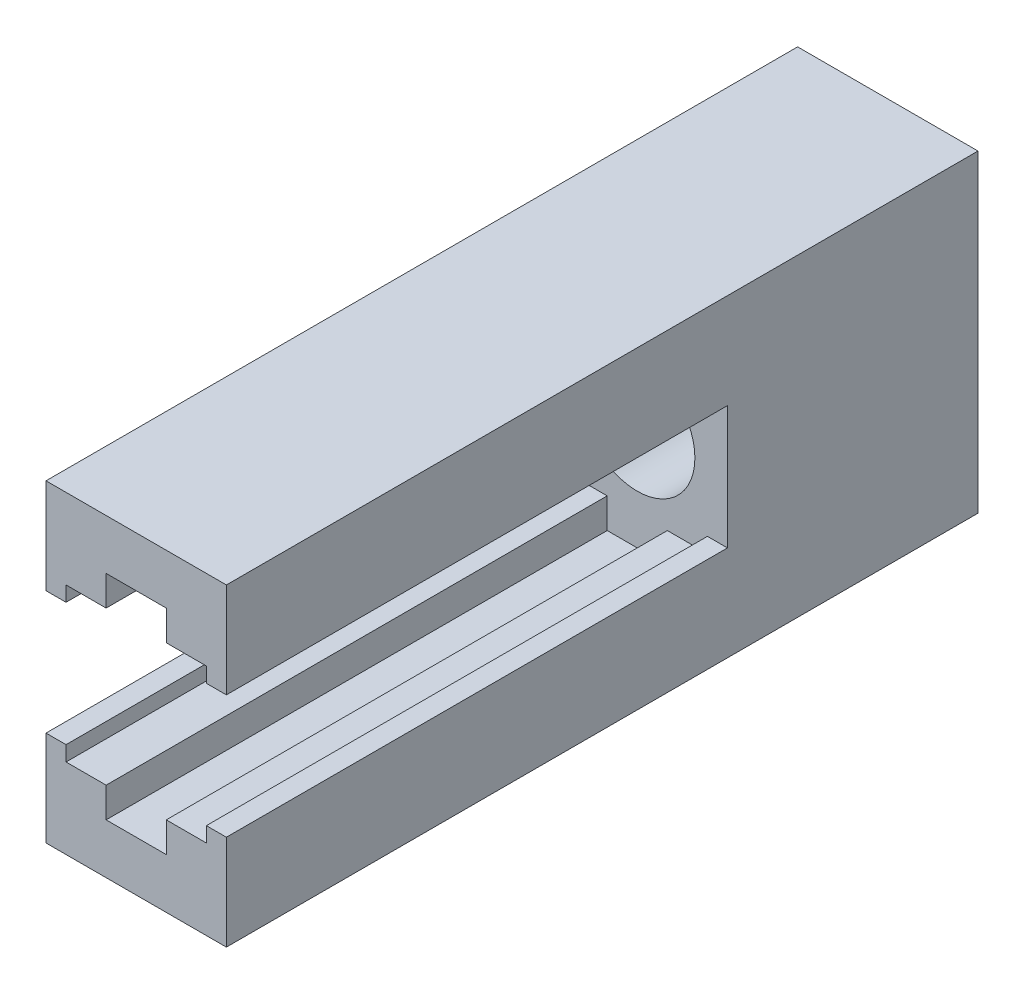
ISO-10303-21;
HEADER;
FILE_DESCRIPTION(('STEP AP214'),'2;1');
FILE_NAME('part.step','',(''),(''),'','','');
FILE_SCHEMA(('AUTOMOTIVE_DESIGN { 1 0 10303 214 1 1 1 1 }'));
ENDSEC;
DATA;
#1=APPLICATION_CONTEXT('core data for automotive mechanical design processes');
#2=APPLICATION_PROTOCOL_DEFINITION('international standard','automotive_design',2000,#1);
#3=PRODUCT_CONTEXT('',#1,'mechanical');
#4=PRODUCT('Part','Part','',(#3));
#5=PRODUCT_RELATED_PRODUCT_CATEGORY('part','',(#4));
#6=PRODUCT_DEFINITION_FORMATION('','',#4);
#7=PRODUCT_DEFINITION_CONTEXT('part definition',#1,'design');
#8=PRODUCT_DEFINITION('design','',#6,#7);
#9=PRODUCT_DEFINITION_SHAPE('','',#8);
#10=(LENGTH_UNIT() NAMED_UNIT(*) SI_UNIT(.MILLI.,.METRE.));
#11=(NAMED_UNIT(*) PLANE_ANGLE_UNIT() SI_UNIT($,.RADIAN.));
#12=(NAMED_UNIT(*) SI_UNIT($,.STERADIAN.) SOLID_ANGLE_UNIT());
#13=UNCERTAINTY_MEASURE_WITH_UNIT(LENGTH_MEASURE(1.E-05),#10,'distance_accuracy_value','');
#14=(GEOMETRIC_REPRESENTATION_CONTEXT(3) GLOBAL_UNCERTAINTY_ASSIGNED_CONTEXT((#13)) GLOBAL_UNIT_ASSIGNED_CONTEXT((#10,
#11,#12)) REPRESENTATION_CONTEXT('',''));
#15=CARTESIAN_POINT('',(0.,0.,0.));
#16=DIRECTION('',(0.,0.,1.));
#17=DIRECTION('',(1.,0.,0.));
#18=AXIS2_PLACEMENT_3D('',#15,#16,#17);
#19=CARTESIAN_POINT('',(0.,0.,0.));
#20=DIRECTION('',(0.,0.,1.));
#21=DIRECTION('',(1.,0.,0.));
#22=AXIS2_PLACEMENT_3D('',#19,#20,#21);
#23=PLANE('',#22);
#24=CARTESIAN_POINT('',(0.,0.,0.));
#25=DIRECTION('',(0.,0.,1.));
#26=DIRECTION('',(1.,0.,0.));
#27=AXIS2_PLACEMENT_3D('',#24,#25,#26);
#28=CIRCLE('',#27,5.75);
#29=CARTESIAN_POINT('',(5.75,0.,0.));
#30=VERTEX_POINT('',#29);
#31=EDGE_CURVE('E225',#30,#30,#28,.T.);
#32=ORIENTED_EDGE('',*,*,#31,.F.);
#33=EDGE_LOOP('',(#32));
#34=FACE_BOUND('',#33,.T.);
#35=DIRECTION('',(0.,-1.,0.));
#36=VECTOR('',#35,1.);
#37=CARTESIAN_POINT('',(9.,-15.65,0.));
#38=LINE('',#37,#36);
#39=CARTESIAN_POINT('',(9.,6.15,0.));
#40=VERTEX_POINT('',#39);
#41=CARTESIAN_POINT('',(9.,-6.15,0.));
#42=VERTEX_POINT('',#41);
#43=EDGE_CURVE('E212',#40,#42,#38,.T.);
#44=ORIENTED_EDGE('',*,*,#43,.F.);
#45=DIRECTION('',(-1.,0.,0.));
#46=VECTOR('',#45,1.);
#47=CARTESIAN_POINT('',(9.,6.15,0.));
#48=LINE('',#47,#46);
#49=CARTESIAN_POINT('',(7.,6.15,0.));
#50=VERTEX_POINT('',#49);
#51=EDGE_CURVE('E209',#40,#50,#48,.T.);
#52=ORIENTED_EDGE('',*,*,#51,.T.);
#53=DIRECTION('',(0.,1.,0.));
#54=VECTOR('',#53,1.);
#55=CARTESIAN_POINT('',(7.,6.15,0.));
#56=LINE('',#55,#54);
#57=CARTESIAN_POINT('',(7.,7.65,0.));
#58=VERTEX_POINT('',#57);
#59=EDGE_CURVE('E257',#50,#58,#56,.T.);
#60=ORIENTED_EDGE('',*,*,#59,.T.);
#61=DIRECTION('',(-1.,0.,0.));
#62=VECTOR('',#61,1.);
#63=CARTESIAN_POINT('',(7.,7.65,0.));
#64=LINE('',#63,#62);
#65=CARTESIAN_POINT('',(3.,7.65,0.));
#66=VERTEX_POINT('',#65);
#67=EDGE_CURVE('E261',#58,#66,#64,.T.);
#68=ORIENTED_EDGE('',*,*,#67,.T.);
#69=DIRECTION('',(0.,1.,0.));
#70=VECTOR('',#69,1.);
#71=CARTESIAN_POINT('',(3.,10.65,0.));
#72=LINE('',#71,#70);
#73=CARTESIAN_POINT('',(3.,10.65,0.));
#74=VERTEX_POINT('',#73);
#75=EDGE_CURVE('E264',#66,#74,#72,.T.);
#76=ORIENTED_EDGE('',*,*,#75,.T.);
#77=DIRECTION('',(-1.,0.,0.));
#78=VECTOR('',#77,1.);
#79=CARTESIAN_POINT('',(-3.,10.65,0.));
#80=LINE('',#79,#78);
#81=CARTESIAN_POINT('',(-3.,10.65,0.));
#82=VERTEX_POINT('',#81);
#83=EDGE_CURVE('E267',#74,#82,#80,.T.);
#84=ORIENTED_EDGE('',*,*,#83,.T.);
#85=DIRECTION('',(0.,-1.,0.));
#86=VECTOR('',#85,1.);
#87=CARTESIAN_POINT('',(-3.,10.65,0.));
#88=LINE('',#87,#86);
#89=CARTESIAN_POINT('',(-3.,7.65,0.));
#90=VERTEX_POINT('',#89);
#91=EDGE_CURVE('E270',#82,#90,#88,.T.);
#92=ORIENTED_EDGE('',*,*,#91,.T.);
#93=DIRECTION('',(-1.,0.,0.));
#94=VECTOR('',#93,1.);
#95=CARTESIAN_POINT('',(-7.,7.65,0.));
#96=LINE('',#95,#94);
#97=CARTESIAN_POINT('',(-7.,7.65,0.));
#98=VERTEX_POINT('',#97);
#99=EDGE_CURVE('E273',#90,#98,#96,.T.);
#100=ORIENTED_EDGE('',*,*,#99,.T.);
#101=DIRECTION('',(0.,-1.,0.));
#102=VECTOR('',#101,1.);
#103=CARTESIAN_POINT('',(-7.,6.15,0.));
#104=LINE('',#103,#102);
#105=CARTESIAN_POINT('',(-7.,6.15,0.));
#106=VERTEX_POINT('',#105);
#107=EDGE_CURVE('E222',#98,#106,#104,.T.);
#108=ORIENTED_EDGE('',*,*,#107,.T.);
#109=DIRECTION('',(-1.,0.,0.));
#110=VECTOR('',#109,1.);
#111=CARTESIAN_POINT('',(-9.,6.15,0.));
#112=LINE('',#111,#110);
#113=CARTESIAN_POINT('',(-9.,6.15,0.));
#114=VERTEX_POINT('',#113);
#115=EDGE_CURVE('E219',#106,#114,#112,.T.);
#116=ORIENTED_EDGE('',*,*,#115,.T.);
#117=DIRECTION('',(0.,1.,0.));
#118=VECTOR('',#117,1.);
#119=CARTESIAN_POINT('',(-9.,-15.65,0.));
#120=LINE('',#119,#118);
#121=CARTESIAN_POINT('',(-9.,-6.15,0.));
#122=VERTEX_POINT('',#121);
#123=EDGE_CURVE('E305',#122,#114,#120,.T.);
#124=ORIENTED_EDGE('',*,*,#123,.F.);
#125=DIRECTION('',(-1.,0.,0.));
#126=VECTOR('',#125,1.);
#127=CARTESIAN_POINT('',(-9.,-6.15,0.));
#128=LINE('',#127,#126);
#129=CARTESIAN_POINT('',(-7.,-6.15,0.));
#130=VERTEX_POINT('',#129);
#131=EDGE_CURVE('E322',#130,#122,#128,.T.);
#132=ORIENTED_EDGE('',*,*,#131,.F.);
#133=DIRECTION('',(0.,1.,0.));
#134=VECTOR('',#133,1.);
#135=CARTESIAN_POINT('',(-7.,-6.15,0.));
#136=LINE('',#135,#134);
#137=CARTESIAN_POINT('',(-7.,-7.65,0.));
#138=VERTEX_POINT('',#137);
#139=EDGE_CURVE('E364',#138,#130,#136,.T.);
#140=ORIENTED_EDGE('',*,*,#139,.F.);
#141=DIRECTION('',(-1.,0.,0.));
#142=VECTOR('',#141,1.);
#143=CARTESIAN_POINT('',(-7.,-7.65,0.));
#144=LINE('',#143,#142);
#145=CARTESIAN_POINT('',(-3.,-7.65,0.));
#146=VERTEX_POINT('',#145);
#147=EDGE_CURVE('E361',#146,#138,#144,.T.);
#148=ORIENTED_EDGE('',*,*,#147,.F.);
#149=DIRECTION('',(0.,1.,0.));
#150=VECTOR('',#149,1.);
#151=CARTESIAN_POINT('',(-3.,-10.65,0.));
#152=LINE('',#151,#150);
#153=CARTESIAN_POINT('',(-3.,-10.65,0.));
#154=VERTEX_POINT('',#153);
#155=EDGE_CURVE('E358',#154,#146,#152,.T.);
#156=ORIENTED_EDGE('',*,*,#155,.F.);
#157=DIRECTION('',(-1.,0.,0.));
#158=VECTOR('',#157,1.);
#159=CARTESIAN_POINT('',(-3.,-10.65,0.));
#160=LINE('',#159,#158);
#161=CARTESIAN_POINT('',(3.,-10.65,0.));
#162=VERTEX_POINT('',#161);
#163=EDGE_CURVE('E355',#162,#154,#160,.T.);
#164=ORIENTED_EDGE('',*,*,#163,.F.);
#165=DIRECTION('',(0.,-1.,0.));
#166=VECTOR('',#165,1.);
#167=CARTESIAN_POINT('',(3.,-10.65,0.));
#168=LINE('',#167,#166);
#169=CARTESIAN_POINT('',(3.,-7.65,0.));
#170=VERTEX_POINT('',#169);
#171=EDGE_CURVE('E352',#170,#162,#168,.T.);
#172=ORIENTED_EDGE('',*,*,#171,.F.);
#173=DIRECTION('',(-1.,0.,0.));
#174=VECTOR('',#173,1.);
#175=CARTESIAN_POINT('',(7.,-7.65,0.));
#176=LINE('',#175,#174);
#177=CARTESIAN_POINT('',(7.,-7.65,0.));
#178=VERTEX_POINT('',#177);
#179=EDGE_CURVE('E349',#178,#170,#176,.T.);
#180=ORIENTED_EDGE('',*,*,#179,.F.);
#181=DIRECTION('',(0.,-1.,0.));
#182=VECTOR('',#181,1.);
#183=CARTESIAN_POINT('',(7.,-6.15,0.));
#184=LINE('',#183,#182);
#185=CARTESIAN_POINT('',(7.,-6.15,0.));
#186=VERTEX_POINT('',#185);
#187=EDGE_CURVE('E346',#186,#178,#184,.T.);
#188=ORIENTED_EDGE('',*,*,#187,.F.);
#189=DIRECTION('',(-1.,0.,0.));
#190=VECTOR('',#189,1.);
#191=CARTESIAN_POINT('',(9.,-6.15,0.));
#192=LINE('',#191,#190);
#193=EDGE_CURVE('E318',#42,#186,#192,.T.);
#194=ORIENTED_EDGE('',*,*,#193,.F.);
#195=EDGE_LOOP('',(#44,#52,#60,#68,#76,#84,#92,#100,#108,#116,#124,#132,#140,#148,#156,#164,
#172,#180,#188,#194));
#196=FACE_BOUND('',#195,.T.);
#197=ADVANCED_FACE('F37',(#34,#196),#23,.T.);
#198=CARTESIAN_POINT('',(9.,-7.65,50.));
#199=DIRECTION('',(-1.,0.,0.));
#200=DIRECTION('',(0.,0.,1.));
#201=AXIS2_PLACEMENT_3D('',#198,#199,#200);
#202=PLANE('',#201);
#203=DIRECTION('',(0.,0.,-1.));
#204=VECTOR('',#203,1.);
#205=CARTESIAN_POINT('',(9.,-15.65,50.));
#206=LINE('',#205,#204);
#207=CARTESIAN_POINT('',(9.,-15.65,50.));
#208=VERTEX_POINT('',#207);
#209=CARTESIAN_POINT('',(9.,-15.65,-25.));
#210=VERTEX_POINT('',#209);
#211=EDGE_CURVE('E343',#208,#210,#206,.T.);
#212=ORIENTED_EDGE('',*,*,#211,.T.);
#213=DIRECTION('',(0.,-1.,0.));
#214=VECTOR('',#213,1.);
#215=CARTESIAN_POINT('',(9.,-15.65,-25.));
#216=LINE('',#215,#214);
#217=CARTESIAN_POINT('',(9.,15.65,-25.));
#218=VERTEX_POINT('',#217);
#219=EDGE_CURVE('E301',#218,#210,#216,.T.);
#220=ORIENTED_EDGE('',*,*,#219,.F.);
#221=DIRECTION('',(0.,0.,1.));
#222=VECTOR('',#221,1.);
#223=CARTESIAN_POINT('',(9.,15.65,-25.));
#224=LINE('',#223,#222);
#225=CARTESIAN_POINT('',(9.,15.65,50.));
#226=VERTEX_POINT('',#225);
#227=EDGE_CURVE('E217',#218,#226,#224,.T.);
#228=ORIENTED_EDGE('',*,*,#227,.T.);
#229=DIRECTION('',(0.,-1.,0.));
#230=VECTOR('',#229,1.);
#231=CARTESIAN_POINT('',(9.,15.65,50.));
#232=LINE('',#231,#230);
#233=CARTESIAN_POINT('',(9.,6.15,50.));
#234=VERTEX_POINT('',#233);
#235=EDGE_CURVE('E198',#226,#234,#232,.T.);
#236=ORIENTED_EDGE('',*,*,#235,.T.);
#237=DIRECTION('',(0.,0.,-1.));
#238=VECTOR('',#237,1.);
#239=CARTESIAN_POINT('',(9.,6.15,50.));
#240=LINE('',#239,#238);
#241=EDGE_CURVE('E206',#234,#40,#240,.T.);
#242=ORIENTED_EDGE('',*,*,#241,.T.);
#243=ORIENTED_EDGE('',*,*,#43,.T.);
#244=DIRECTION('',(0.,0.,-1.));
#245=VECTOR('',#244,1.);
#246=CARTESIAN_POINT('',(9.,-6.15,50.));
#247=LINE('',#246,#245);
#248=CARTESIAN_POINT('',(9.,-6.15,50.));
#249=VERTEX_POINT('',#248);
#250=EDGE_CURVE('E11',#249,#42,#247,.T.);
#251=ORIENTED_EDGE('',*,*,#250,.F.);
#252=DIRECTION('',(0.,1.,0.));
#253=VECTOR('',#252,1.);
#254=CARTESIAN_POINT('',(9.,-15.65,50.));
#255=LINE('',#254,#253);
#256=EDGE_CURVE('E319',#208,#249,#255,.T.);
#257=ORIENTED_EDGE('',*,*,#256,.F.);
#258=EDGE_LOOP('',(#212,#220,#228,#236,#242,#243,#251,#257));
#259=FACE_BOUND('',#258,.T.);
#260=ADVANCED_FACE('F39',(#259),#202,.F.);
#261=CARTESIAN_POINT('',(9.,-6.15,50.));
#262=DIRECTION('',(0.,-1.,0.));
#263=DIRECTION('',(0.,0.,-1.));
#264=AXIS2_PLACEMENT_3D('',#261,#262,#263);
#265=PLANE('',#264);
#266=ORIENTED_EDGE('',*,*,#193,.T.);
#267=DIRECTION('',(0.,0.,-1.));
#268=VECTOR('',#267,1.);
#269=CARTESIAN_POINT('',(7.,-6.15,50.));
#270=LINE('',#269,#268);
#271=CARTESIAN_POINT('',(7.,-6.15,50.));
#272=VERTEX_POINT('',#271);
#273=EDGE_CURVE('E46',#272,#186,#270,.T.);
#274=ORIENTED_EDGE('',*,*,#273,.F.);
#275=DIRECTION('',(-1.,0.,0.));
#276=VECTOR('',#275,1.);
#277=CARTESIAN_POINT('',(9.,-6.15,50.));
#278=LINE('',#277,#276);
#279=EDGE_CURVE('E321',#249,#272,#278,.T.);
#280=ORIENTED_EDGE('',*,*,#279,.F.);
#281=ORIENTED_EDGE('',*,*,#250,.T.);
#282=EDGE_LOOP('',(#266,#274,#280,#281));
#283=FACE_BOUND('',#282,.T.);
#284=ADVANCED_FACE('F404',(#283),#265,.F.);
#285=CARTESIAN_POINT('',(7.,-6.15,50.));
#286=DIRECTION('',(1.,0.,0.));
#287=DIRECTION('',(0.,0.,-1.));
#288=AXIS2_PLACEMENT_3D('',#285,#286,#287);
#289=PLANE('',#288);
#290=ORIENTED_EDGE('',*,*,#187,.T.);
#291=DIRECTION('',(0.,0.,-1.));
#292=VECTOR('',#291,1.);
#293=CARTESIAN_POINT('',(7.,-7.65,50.));
#294=LINE('',#293,#292);
#295=CARTESIAN_POINT('',(7.,-7.65,50.));
#296=VERTEX_POINT('',#295);
#297=EDGE_CURVE('E393',#296,#178,#294,.T.);
#298=ORIENTED_EDGE('',*,*,#297,.F.);
#299=DIRECTION('',(0.,-1.,0.));
#300=VECTOR('',#299,1.);
#301=CARTESIAN_POINT('',(7.,-6.15,50.));
#302=LINE('',#301,#300);
#303=EDGE_CURVE('E324',#272,#296,#302,.T.);
#304=ORIENTED_EDGE('',*,*,#303,.F.);
#305=ORIENTED_EDGE('',*,*,#273,.T.);
#306=EDGE_LOOP('',(#290,#298,#304,#305));
#307=FACE_BOUND('',#306,.T.);
#308=ADVANCED_FACE('F399',(#307),#289,.F.);
#309=CARTESIAN_POINT('',(7.,-7.65,50.));
#310=DIRECTION('',(0.,-1.,0.));
#311=DIRECTION('',(1.,0.,0.));
#312=AXIS2_PLACEMENT_3D('',#309,#310,#311);
#313=PLANE('',#312);
#314=ORIENTED_EDGE('',*,*,#179,.T.);
#315=DIRECTION('',(0.,0.,-1.));
#316=VECTOR('',#315,1.);
#317=CARTESIAN_POINT('',(3.,-7.65,50.));
#318=LINE('',#317,#316);
#319=CARTESIAN_POINT('',(3.,-7.65,50.));
#320=VERTEX_POINT('',#319);
#321=EDGE_CURVE('E390',#320,#170,#318,.T.);
#322=ORIENTED_EDGE('',*,*,#321,.F.);
#323=DIRECTION('',(-1.,0.,0.));
#324=VECTOR('',#323,1.);
#325=CARTESIAN_POINT('',(7.,-7.65,50.));
#326=LINE('',#325,#324);
#327=EDGE_CURVE('E326',#296,#320,#326,.T.);
#328=ORIENTED_EDGE('',*,*,#327,.F.);
#329=ORIENTED_EDGE('',*,*,#297,.T.);
#330=EDGE_LOOP('',(#314,#322,#328,#329));
#331=FACE_BOUND('',#330,.T.);
#332=ADVANCED_FACE('F410',(#331),#313,.F.);
#333=CARTESIAN_POINT('',(3.,-10.65,50.));
#334=DIRECTION('',(1.,0.,0.));
#335=DIRECTION('',(0.,1.,0.));
#336=AXIS2_PLACEMENT_3D('',#333,#334,#335);
#337=PLANE('',#336);
#338=ORIENTED_EDGE('',*,*,#171,.T.);
#339=DIRECTION('',(0.,0.,-1.));
#340=VECTOR('',#339,1.);
#341=CARTESIAN_POINT('',(3.,-10.65,50.));
#342=LINE('',#341,#340);
#343=CARTESIAN_POINT('',(3.,-10.65,50.));
#344=VERTEX_POINT('',#343);
#345=EDGE_CURVE('E387',#344,#162,#342,.T.);
#346=ORIENTED_EDGE('',*,*,#345,.F.);
#347=DIRECTION('',(0.,-1.,0.));
#348=VECTOR('',#347,1.);
#349=CARTESIAN_POINT('',(3.,-10.65,50.));
#350=LINE('',#349,#348);
#351=EDGE_CURVE('E328',#320,#344,#350,.T.);
#352=ORIENTED_EDGE('',*,*,#351,.F.);
#353=ORIENTED_EDGE('',*,*,#321,.T.);
#354=EDGE_LOOP('',(#338,#346,#352,#353));
#355=FACE_BOUND('',#354,.T.);
#356=ADVANCED_FACE('F414',(#355),#337,.F.);
#357=CARTESIAN_POINT('',(-3.,-10.65,50.));
#358=DIRECTION('',(0.,-1.,0.));
#359=DIRECTION('',(0.,0.,-1.));
#360=AXIS2_PLACEMENT_3D('',#357,#358,#359);
#361=PLANE('',#360);
#362=ORIENTED_EDGE('',*,*,#163,.T.);
#363=DIRECTION('',(0.,0.,-1.));
#364=VECTOR('',#363,1.);
#365=CARTESIAN_POINT('',(-3.,-10.65,50.));
#366=LINE('',#365,#364);
#367=CARTESIAN_POINT('',(-3.,-10.65,50.));
#368=VERTEX_POINT('',#367);
#369=EDGE_CURVE('E384',#368,#154,#366,.T.);
#370=ORIENTED_EDGE('',*,*,#369,.F.);
#371=DIRECTION('',(-1.,0.,0.));
#372=VECTOR('',#371,1.);
#373=CARTESIAN_POINT('',(-3.,-10.65,50.));
#374=LINE('',#373,#372);
#375=EDGE_CURVE('E330',#344,#368,#374,.T.);
#376=ORIENTED_EDGE('',*,*,#375,.F.);
#377=ORIENTED_EDGE('',*,*,#345,.T.);
#378=EDGE_LOOP('',(#362,#370,#376,#377));
#379=FACE_BOUND('',#378,.T.);
#380=ADVANCED_FACE('F475',(#379),#361,.F.);
#381=CARTESIAN_POINT('',(-3.,-10.65,50.));
#382=DIRECTION('',(-1.,0.,0.));
#383=DIRECTION('',(0.,0.,1.));
#384=AXIS2_PLACEMENT_3D('',#381,#382,#383);
#385=PLANE('',#384);
#386=ORIENTED_EDGE('',*,*,#155,.T.);
#387=DIRECTION('',(0.,0.,-1.));
#388=VECTOR('',#387,1.);
#389=CARTESIAN_POINT('',(-3.,-7.65,50.));
#390=LINE('',#389,#388);
#391=CARTESIAN_POINT('',(-3.,-7.65,50.));
#392=VERTEX_POINT('',#391);
#393=EDGE_CURVE('E381',#392,#146,#390,.T.);
#394=ORIENTED_EDGE('',*,*,#393,.F.);
#395=DIRECTION('',(0.,1.,0.));
#396=VECTOR('',#395,1.);
#397=CARTESIAN_POINT('',(-3.,-10.65,50.));
#398=LINE('',#397,#396);
#399=EDGE_CURVE('E332',#368,#392,#398,.T.);
#400=ORIENTED_EDGE('',*,*,#399,.F.);
#401=ORIENTED_EDGE('',*,*,#369,.T.);
#402=EDGE_LOOP('',(#386,#394,#400,#401));
#403=FACE_BOUND('',#402,.T.);
#404=ADVANCED_FACE('F473',(#403),#385,.F.);
#405=CARTESIAN_POINT('',(-7.,-7.65,50.));
#406=DIRECTION('',(0.,-1.,0.));
#407=DIRECTION('',(1.,0.,0.));
#408=AXIS2_PLACEMENT_3D('',#405,#406,#407);
#409=PLANE('',#408);
#410=ORIENTED_EDGE('',*,*,#147,.T.);
#411=DIRECTION('',(0.,0.,-1.));
#412=VECTOR('',#411,1.);
#413=CARTESIAN_POINT('',(-7.,-7.65,50.));
#414=LINE('',#413,#412);
#415=CARTESIAN_POINT('',(-7.,-7.65,50.));
#416=VERTEX_POINT('',#415);
#417=EDGE_CURVE('E378',#416,#138,#414,.T.);
#418=ORIENTED_EDGE('',*,*,#417,.F.);
#419=DIRECTION('',(-1.,0.,0.));
#420=VECTOR('',#419,1.);
#421=CARTESIAN_POINT('',(-7.,-7.65,50.));
#422=LINE('',#421,#420);
#423=EDGE_CURVE('E334',#392,#416,#422,.T.);
#424=ORIENTED_EDGE('',*,*,#423,.F.);
#425=ORIENTED_EDGE('',*,*,#393,.T.);
#426=EDGE_LOOP('',(#410,#418,#424,#425));
#427=FACE_BOUND('',#426,.T.);
#428=ADVANCED_FACE('F469',(#427),#409,.F.);
#429=CARTESIAN_POINT('',(-7.,-6.15,50.));
#430=DIRECTION('',(-1.,0.,0.));
#431=DIRECTION('',(0.,-1.,0.));
#432=AXIS2_PLACEMENT_3D('',#429,#430,#431);
#433=PLANE('',#432);
#434=ORIENTED_EDGE('',*,*,#139,.T.);
#435=DIRECTION('',(0.,0.,-1.));
#436=VECTOR('',#435,1.);
#437=CARTESIAN_POINT('',(-7.,-6.15,50.));
#438=LINE('',#437,#436);
#439=CARTESIAN_POINT('',(-7.,-6.15,50.));
#440=VERTEX_POINT('',#439);
#441=EDGE_CURVE('E375',#440,#130,#438,.T.);
#442=ORIENTED_EDGE('',*,*,#441,.F.);
#443=DIRECTION('',(0.,1.,0.));
#444=VECTOR('',#443,1.);
#445=CARTESIAN_POINT('',(-7.,-6.15,50.));
#446=LINE('',#445,#444);
#447=EDGE_CURVE('E336',#416,#440,#446,.T.);
#448=ORIENTED_EDGE('',*,*,#447,.F.);
#449=ORIENTED_EDGE('',*,*,#417,.T.);
#450=EDGE_LOOP('',(#434,#442,#448,#449));
#451=FACE_BOUND('',#450,.T.);
#452=ADVANCED_FACE('F467',(#451),#433,.F.);
#453=CARTESIAN_POINT('',(-9.,-6.15,50.));
#454=DIRECTION('',(0.,-1.,0.));
#455=DIRECTION('',(0.,0.,-1.));
#456=AXIS2_PLACEMENT_3D('',#453,#454,#455);
#457=PLANE('',#456);
#458=ORIENTED_EDGE('',*,*,#131,.T.);
#459=DIRECTION('',(0.,0.,-1.));
#460=VECTOR('',#459,1.);
#461=CARTESIAN_POINT('',(-9.,-6.15,50.));
#462=LINE('',#461,#460);
#463=CARTESIAN_POINT('',(-9.,-6.15,50.));
#464=VERTEX_POINT('',#463);
#465=EDGE_CURVE('E372',#464,#122,#462,.T.);
#466=ORIENTED_EDGE('',*,*,#465,.F.);
#467=DIRECTION('',(-1.,0.,0.));
#468=VECTOR('',#467,1.);
#469=CARTESIAN_POINT('',(-9.,-6.15,50.));
#470=LINE('',#469,#468);
#471=EDGE_CURVE('E338',#440,#464,#470,.T.);
#472=ORIENTED_EDGE('',*,*,#471,.F.);
#473=ORIENTED_EDGE('',*,*,#441,.T.);
#474=EDGE_LOOP('',(#458,#466,#472,#473));
#475=FACE_BOUND('',#474,.T.);
#476=ADVANCED_FACE('F459',(#475),#457,.F.);
#477=CARTESIAN_POINT('',(-9.,-15.65,50.));
#478=DIRECTION('',(1.,0.,0.));
#479=DIRECTION('',(0.,1.,0.));
#480=AXIS2_PLACEMENT_3D('',#477,#478,#479);
#481=PLANE('',#480);
#482=ORIENTED_EDGE('',*,*,#465,.T.);
#483=ORIENTED_EDGE('',*,*,#123,.T.);
#484=DIRECTION('',(0.,0.,-1.));
#485=VECTOR('',#484,1.);
#486=CARTESIAN_POINT('',(-9.,6.15,50.));
#487=LINE('',#486,#485);
#488=CARTESIAN_POINT('',(-9.,6.15,50.));
#489=VERTEX_POINT('',#488);
#490=EDGE_CURVE('E255',#489,#114,#487,.T.);
#491=ORIENTED_EDGE('',*,*,#490,.F.);
#492=DIRECTION('',(0.,1.,0.));
#493=VECTOR('',#492,1.);
#494=CARTESIAN_POINT('',(-9.,7.65,50.));
#495=LINE('',#494,#493);
#496=CARTESIAN_POINT('',(-9.,15.65,50.));
#497=VERTEX_POINT('',#496);
#498=EDGE_CURVE('E250',#489,#497,#495,.T.);
#499=ORIENTED_EDGE('',*,*,#498,.T.);
#500=DIRECTION('',(0.,0.,1.));
#501=VECTOR('',#500,1.);
#502=CARTESIAN_POINT('',(-9.,15.65,-25.));
#503=LINE('',#502,#501);
#504=CARTESIAN_POINT('',(-9.,15.65,-25.));
#505=VERTEX_POINT('',#504);
#506=EDGE_CURVE('E316',#505,#497,#503,.T.);
#507=ORIENTED_EDGE('',*,*,#506,.F.);
#508=DIRECTION('',(0.,1.,0.));
#509=VECTOR('',#508,1.);
#510=CARTESIAN_POINT('',(-9.,-15.65,-25.));
#511=LINE('',#510,#509);
#512=CARTESIAN_POINT('',(-9.,-15.65,-25.));
#513=VERTEX_POINT('',#512);
#514=EDGE_CURVE('E308',#513,#505,#511,.T.);
#515=ORIENTED_EDGE('',*,*,#514,.F.);
#516=DIRECTION('',(0.,0.,-1.));
#517=VECTOR('',#516,1.);
#518=CARTESIAN_POINT('',(-9.,-15.65,50.));
#519=LINE('',#518,#517);
#520=CARTESIAN_POINT('',(-9.,-15.65,50.));
#521=VERTEX_POINT('',#520);
#522=EDGE_CURVE('E370',#521,#513,#519,.T.);
#523=ORIENTED_EDGE('',*,*,#522,.F.);
#524=DIRECTION('',(0.,-1.,0.));
#525=VECTOR('',#524,1.);
#526=CARTESIAN_POINT('',(-9.,-7.65,50.));
#527=LINE('',#526,#525);
#528=EDGE_CURVE('E340',#464,#521,#527,.T.);
#529=ORIENTED_EDGE('',*,*,#528,.F.);
#530=EDGE_LOOP('',(#482,#483,#491,#499,#507,#515,#523,#529));
#531=FACE_BOUND('',#530,.T.);
#532=ADVANCED_FACE('F433',(#531),#481,.F.);
#533=CARTESIAN_POINT('',(-9.,-15.65,50.));
#534=DIRECTION('',(0.,1.,0.));
#535=DIRECTION('',(0.,0.,1.));
#536=AXIS2_PLACEMENT_3D('',#533,#534,#535);
#537=PLANE('',#536);
#538=ORIENTED_EDGE('',*,*,#522,.T.);
#539=DIRECTION('',(-1.,0.,0.));
#540=VECTOR('',#539,1.);
#541=CARTESIAN_POINT('',(9.,-15.65,-25.));
#542=LINE('',#541,#540);
#543=EDGE_CURVE('E304',#210,#513,#542,.T.);
#544=ORIENTED_EDGE('',*,*,#543,.F.);
#545=ORIENTED_EDGE('',*,*,#211,.F.);
#546=DIRECTION('',(1.,0.,0.));
#547=VECTOR('',#546,1.);
#548=CARTESIAN_POINT('',(-9.,-15.65,50.));
#549=LINE('',#548,#547);
#550=EDGE_CURVE('E53',#521,#208,#549,.T.);
#551=ORIENTED_EDGE('',*,*,#550,.F.);
#552=EDGE_LOOP('',(#538,#544,#545,#551));
#553=FACE_BOUND('',#552,.T.);
#554=ADVANCED_FACE('F422',(#553),#537,.F.);
#555=CARTESIAN_POINT('',(0.,0.,50.));
#556=DIRECTION('',(0.,0.,1.));
#557=DIRECTION('',(1.,0.,0.));
#558=AXIS2_PLACEMENT_3D('',#555,#556,#557);
#559=PLANE('',#558);
#560=ORIENTED_EDGE('',*,*,#256,.T.);
#561=ORIENTED_EDGE('',*,*,#279,.T.);
#562=ORIENTED_EDGE('',*,*,#303,.T.);
#563=ORIENTED_EDGE('',*,*,#327,.T.);
#564=ORIENTED_EDGE('',*,*,#351,.T.);
#565=ORIENTED_EDGE('',*,*,#375,.T.);
#566=ORIENTED_EDGE('',*,*,#399,.T.);
#567=ORIENTED_EDGE('',*,*,#423,.T.);
#568=ORIENTED_EDGE('',*,*,#447,.T.);
#569=ORIENTED_EDGE('',*,*,#471,.T.);
#570=ORIENTED_EDGE('',*,*,#528,.T.);
#571=ORIENTED_EDGE('',*,*,#550,.T.);
#572=EDGE_LOOP('',(#560,#561,#562,#563,#564,#565,#566,#567,#568,#569,#570,#571));
#573=FACE_BOUND('',#572,.T.);
#574=ADVANCED_FACE('F417',(#573),#559,.T.);
#575=CARTESIAN_POINT('',(9.,15.65,-25.));
#576=DIRECTION('',(0.,-1.,0.));
#577=DIRECTION('',(0.,0.,-1.));
#578=AXIS2_PLACEMENT_3D('',#575,#576,#577);
#579=PLANE('',#578);
#580=ORIENTED_EDGE('',*,*,#506,.T.);
#581=DIRECTION('',(1.,0.,0.));
#582=VECTOR('',#581,1.);
#583=CARTESIAN_POINT('',(-9.,15.65,50.));
#584=LINE('',#583,#582);
#585=EDGE_CURVE('E253',#497,#226,#584,.T.);
#586=ORIENTED_EDGE('',*,*,#585,.T.);
#587=ORIENTED_EDGE('',*,*,#227,.F.);
#588=DIRECTION('',(1.,0.,0.));
#589=VECTOR('',#588,1.);
#590=CARTESIAN_POINT('',(9.,15.65,-25.));
#591=LINE('',#590,#589);
#592=EDGE_CURVE('E310',#505,#218,#591,.T.);
#593=ORIENTED_EDGE('',*,*,#592,.F.);
#594=EDGE_LOOP('',(#580,#586,#587,#593));
#595=FACE_BOUND('',#594,.T.);
#596=ADVANCED_FACE('F430',(#595),#579,.F.);
#597=CARTESIAN_POINT('',(0.,0.,-25.));
#598=DIRECTION('',(0.,0.,1.));
#599=DIRECTION('',(1.,0.,0.));
#600=AXIS2_PLACEMENT_3D('',#597,#598,#599);
#601=PLANE('',#600);
#602=CARTESIAN_POINT('',(0.,0.,-25.));
#603=DIRECTION('',(0.,0.,1.));
#604=DIRECTION('',(1.,0.,0.));
#605=AXIS2_PLACEMENT_3D('',#602,#603,#604);
#606=CIRCLE('',#605,3.5);
#607=CARTESIAN_POINT('',(3.5,0.,-25.));
#608=VERTEX_POINT('',#607);
#609=EDGE_CURVE('E748',#608,#608,#606,.T.);
#610=ORIENTED_EDGE('',*,*,#609,.T.);
#611=EDGE_LOOP('',(#610));
#612=FACE_BOUND('',#611,.T.);
#613=ORIENTED_EDGE('',*,*,#219,.T.);
#614=ORIENTED_EDGE('',*,*,#543,.T.);
#615=ORIENTED_EDGE('',*,*,#514,.T.);
#616=ORIENTED_EDGE('',*,*,#592,.T.);
#617=EDGE_LOOP('',(#613,#614,#615,#616));
#618=FACE_BOUND('',#617,.T.);
#619=ADVANCED_FACE('F426',(#612,#618),#601,.F.);
#620=CARTESIAN_POINT('',(9.,6.15,50.));
#621=DIRECTION('',(0.,1.,0.));
#622=DIRECTION('',(0.,0.,-1.));
#623=AXIS2_PLACEMENT_3D('',#620,#621,#622);
#624=PLANE('',#623);
#625=ORIENTED_EDGE('',*,*,#51,.F.);
#626=ORIENTED_EDGE('',*,*,#241,.F.);
#627=DIRECTION('',(-1.,0.,0.));
#628=VECTOR('',#627,1.);
#629=CARTESIAN_POINT('',(9.,6.15,50.));
#630=LINE('',#629,#628);
#631=CARTESIAN_POINT('',(7.,6.15,50.));
#632=VERTEX_POINT('',#631);
#633=EDGE_CURVE('E193',#234,#632,#630,.T.);
#634=ORIENTED_EDGE('',*,*,#633,.T.);
#635=DIRECTION('',(0.,0.,-1.));
#636=VECTOR('',#635,1.);
#637=CARTESIAN_POINT('',(7.,6.15,50.));
#638=LINE('',#637,#636);
#639=EDGE_CURVE('E213',#632,#50,#638,.T.);
#640=ORIENTED_EDGE('',*,*,#639,.T.);
#641=EDGE_LOOP('',(#625,#626,#634,#640));
#642=FACE_BOUND('',#641,.T.);
#643=ADVANCED_FACE('F207',(#642),#624,.F.);
#644=CARTESIAN_POINT('',(7.,6.15,50.));
#645=DIRECTION('',(1.,0.,0.));
#646=DIRECTION('',(0.,0.,-1.));
#647=AXIS2_PLACEMENT_3D('',#644,#645,#646);
#648=PLANE('',#647);
#649=ORIENTED_EDGE('',*,*,#59,.F.);
#650=ORIENTED_EDGE('',*,*,#639,.F.);
#651=DIRECTION('',(0.,1.,0.));
#652=VECTOR('',#651,1.);
#653=CARTESIAN_POINT('',(7.,6.15,50.));
#654=LINE('',#653,#652);
#655=CARTESIAN_POINT('',(7.,7.65,50.));
#656=VERTEX_POINT('',#655);
#657=EDGE_CURVE('E200',#632,#656,#654,.T.);
#658=ORIENTED_EDGE('',*,*,#657,.T.);
#659=DIRECTION('',(0.,0.,-1.));
#660=VECTOR('',#659,1.);
#661=CARTESIAN_POINT('',(7.,7.65,50.));
#662=LINE('',#661,#660);
#663=EDGE_CURVE('E297',#656,#58,#662,.T.);
#664=ORIENTED_EDGE('',*,*,#663,.T.);
#665=EDGE_LOOP('',(#649,#650,#658,#664));
#666=FACE_BOUND('',#665,.T.);
#667=ADVANCED_FACE('F456',(#666),#648,.F.);
#668=CARTESIAN_POINT('',(7.,7.65,50.));
#669=DIRECTION('',(0.,1.,0.));
#670=DIRECTION('',(1.,0.,0.));
#671=AXIS2_PLACEMENT_3D('',#668,#669,#670);
#672=PLANE('',#671);
#673=ORIENTED_EDGE('',*,*,#67,.F.);
#674=ORIENTED_EDGE('',*,*,#663,.F.);
#675=DIRECTION('',(-1.,0.,0.));
#676=VECTOR('',#675,1.);
#677=CARTESIAN_POINT('',(7.,7.65,50.));
#678=LINE('',#677,#676);
#679=CARTESIAN_POINT('',(3.,7.65,50.));
#680=VERTEX_POINT('',#679);
#681=EDGE_CURVE('E229',#656,#680,#678,.T.);
#682=ORIENTED_EDGE('',*,*,#681,.T.);
#683=DIRECTION('',(0.,0.,-1.));
#684=VECTOR('',#683,1.);
#685=CARTESIAN_POINT('',(3.,7.65,50.));
#686=LINE('',#685,#684);
#687=EDGE_CURVE('E294',#680,#66,#686,.T.);
#688=ORIENTED_EDGE('',*,*,#687,.T.);
#689=EDGE_LOOP('',(#673,#674,#682,#688));
#690=FACE_BOUND('',#689,.T.);
#691=ADVANCED_FACE('F454',(#690),#672,.F.);
#692=CARTESIAN_POINT('',(3.,10.65,50.));
#693=DIRECTION('',(1.,0.,0.));
#694=DIRECTION('',(0.,-1.,0.));
#695=AXIS2_PLACEMENT_3D('',#692,#693,#694);
#696=PLANE('',#695);
#697=ORIENTED_EDGE('',*,*,#75,.F.);
#698=ORIENTED_EDGE('',*,*,#687,.F.);
#699=DIRECTION('',(0.,1.,0.));
#700=VECTOR('',#699,1.);
#701=CARTESIAN_POINT('',(3.,10.65,50.));
#702=LINE('',#701,#700);
#703=CARTESIAN_POINT('',(3.,10.65,50.));
#704=VERTEX_POINT('',#703);
#705=EDGE_CURVE('E232',#680,#704,#702,.T.);
#706=ORIENTED_EDGE('',*,*,#705,.T.);
#707=DIRECTION('',(0.,0.,-1.));
#708=VECTOR('',#707,1.);
#709=CARTESIAN_POINT('',(3.,10.65,50.));
#710=LINE('',#709,#708);
#711=EDGE_CURVE('E291',#704,#74,#710,.T.);
#712=ORIENTED_EDGE('',*,*,#711,.T.);
#713=EDGE_LOOP('',(#697,#698,#706,#712));
#714=FACE_BOUND('',#713,.T.);
#715=ADVANCED_FACE('F451',(#714),#696,.F.);
#716=CARTESIAN_POINT('',(-3.,10.65,50.));
#717=DIRECTION('',(0.,1.,0.));
#718=DIRECTION('',(0.,0.,-1.));
#719=AXIS2_PLACEMENT_3D('',#716,#717,#718);
#720=PLANE('',#719);
#721=ORIENTED_EDGE('',*,*,#83,.F.);
#722=ORIENTED_EDGE('',*,*,#711,.F.);
#723=DIRECTION('',(-1.,0.,0.));
#724=VECTOR('',#723,1.);
#725=CARTESIAN_POINT('',(-3.,10.65,50.));
#726=LINE('',#725,#724);
#727=CARTESIAN_POINT('',(-3.,10.65,50.));
#728=VERTEX_POINT('',#727);
#729=EDGE_CURVE('E235',#704,#728,#726,.T.);
#730=ORIENTED_EDGE('',*,*,#729,.T.);
#731=DIRECTION('',(0.,0.,-1.));
#732=VECTOR('',#731,1.);
#733=CARTESIAN_POINT('',(-3.,10.65,50.));
#734=LINE('',#733,#732);
#735=EDGE_CURVE('E288',#728,#82,#734,.T.);
#736=ORIENTED_EDGE('',*,*,#735,.T.);
#737=EDGE_LOOP('',(#721,#722,#730,#736));
#738=FACE_BOUND('',#737,.T.);
#739=ADVANCED_FACE('F449',(#738),#720,.F.);
#740=CARTESIAN_POINT('',(-3.,10.65,50.));
#741=DIRECTION('',(-1.,0.,0.));
#742=DIRECTION('',(0.,0.,1.));
#743=AXIS2_PLACEMENT_3D('',#740,#741,#742);
#744=PLANE('',#743);
#745=ORIENTED_EDGE('',*,*,#91,.F.);
#746=ORIENTED_EDGE('',*,*,#735,.F.);
#747=DIRECTION('',(0.,-1.,0.));
#748=VECTOR('',#747,1.);
#749=CARTESIAN_POINT('',(-3.,10.65,50.));
#750=LINE('',#749,#748);
#751=CARTESIAN_POINT('',(-3.,7.65,50.));
#752=VERTEX_POINT('',#751);
#753=EDGE_CURVE('E238',#728,#752,#750,.T.);
#754=ORIENTED_EDGE('',*,*,#753,.T.);
#755=DIRECTION('',(0.,0.,-1.));
#756=VECTOR('',#755,1.);
#757=CARTESIAN_POINT('',(-3.,7.65,50.));
#758=LINE('',#757,#756);
#759=EDGE_CURVE('E285',#752,#90,#758,.T.);
#760=ORIENTED_EDGE('',*,*,#759,.T.);
#761=EDGE_LOOP('',(#745,#746,#754,#760));
#762=FACE_BOUND('',#761,.T.);
#763=ADVANCED_FACE('F445',(#762),#744,.F.);
#764=CARTESIAN_POINT('',(-7.,7.65,50.));
#765=DIRECTION('',(0.,1.,0.));
#766=DIRECTION('',(1.,0.,0.));
#767=AXIS2_PLACEMENT_3D('',#764,#765,#766);
#768=PLANE('',#767);
#769=ORIENTED_EDGE('',*,*,#99,.F.);
#770=ORIENTED_EDGE('',*,*,#759,.F.);
#771=DIRECTION('',(-1.,0.,0.));
#772=VECTOR('',#771,1.);
#773=CARTESIAN_POINT('',(-7.,7.65,50.));
#774=LINE('',#773,#772);
#775=CARTESIAN_POINT('',(-7.,7.65,50.));
#776=VERTEX_POINT('',#775);
#777=EDGE_CURVE('E241',#752,#776,#774,.T.);
#778=ORIENTED_EDGE('',*,*,#777,.T.);
#779=DIRECTION('',(0.,0.,-1.));
#780=VECTOR('',#779,1.);
#781=CARTESIAN_POINT('',(-7.,7.65,50.));
#782=LINE('',#781,#780);
#783=EDGE_CURVE('E282',#776,#98,#782,.T.);
#784=ORIENTED_EDGE('',*,*,#783,.T.);
#785=EDGE_LOOP('',(#769,#770,#778,#784));
#786=FACE_BOUND('',#785,.T.);
#787=ADVANCED_FACE('F442',(#786),#768,.F.);
#788=CARTESIAN_POINT('',(-7.,6.15,50.));
#789=DIRECTION('',(-1.,0.,0.));
#790=DIRECTION('',(0.,1.,0.));
#791=AXIS2_PLACEMENT_3D('',#788,#789,#790);
#792=PLANE('',#791);
#793=ORIENTED_EDGE('',*,*,#107,.F.);
#794=ORIENTED_EDGE('',*,*,#783,.F.);
#795=DIRECTION('',(0.,-1.,0.));
#796=VECTOR('',#795,1.);
#797=CARTESIAN_POINT('',(-7.,6.15,50.));
#798=LINE('',#797,#796);
#799=CARTESIAN_POINT('',(-7.,6.15,50.));
#800=VERTEX_POINT('',#799);
#801=EDGE_CURVE('E244',#776,#800,#798,.T.);
#802=ORIENTED_EDGE('',*,*,#801,.T.);
#803=DIRECTION('',(0.,0.,-1.));
#804=VECTOR('',#803,1.);
#805=CARTESIAN_POINT('',(-7.,6.15,50.));
#806=LINE('',#805,#804);
#807=EDGE_CURVE('E279',#800,#106,#806,.T.);
#808=ORIENTED_EDGE('',*,*,#807,.T.);
#809=EDGE_LOOP('',(#793,#794,#802,#808));
#810=FACE_BOUND('',#809,.T.);
#811=ADVANCED_FACE('F440',(#810),#792,.F.);
#812=CARTESIAN_POINT('',(-9.,6.15,50.));
#813=DIRECTION('',(0.,1.,0.));
#814=DIRECTION('',(0.,0.,-1.));
#815=AXIS2_PLACEMENT_3D('',#812,#813,#814);
#816=PLANE('',#815);
#817=ORIENTED_EDGE('',*,*,#115,.F.);
#818=ORIENTED_EDGE('',*,*,#807,.F.);
#819=DIRECTION('',(-1.,0.,0.));
#820=VECTOR('',#819,1.);
#821=CARTESIAN_POINT('',(-9.,6.15,50.));
#822=LINE('',#821,#820);
#823=EDGE_CURVE('E247',#800,#489,#822,.T.);
#824=ORIENTED_EDGE('',*,*,#823,.T.);
#825=ORIENTED_EDGE('',*,*,#490,.T.);
#826=EDGE_LOOP('',(#817,#818,#824,#825));
#827=FACE_BOUND('',#826,.T.);
#828=ADVANCED_FACE('F436',(#827),#816,.F.);
#829=CARTESIAN_POINT('',(0.,0.,50.));
#830=DIRECTION('',(0.,0.,1.));
#831=DIRECTION('',(1.,0.,0.));
#832=AXIS2_PLACEMENT_3D('',#829,#830,#831);
#833=PLANE('',#832);
#834=ORIENTED_EDGE('',*,*,#235,.F.);
#835=ORIENTED_EDGE('',*,*,#585,.F.);
#836=ORIENTED_EDGE('',*,*,#498,.F.);
#837=ORIENTED_EDGE('',*,*,#823,.F.);
#838=ORIENTED_EDGE('',*,*,#801,.F.);
#839=ORIENTED_EDGE('',*,*,#777,.F.);
#840=ORIENTED_EDGE('',*,*,#753,.F.);
#841=ORIENTED_EDGE('',*,*,#729,.F.);
#842=ORIENTED_EDGE('',*,*,#705,.F.);
#843=ORIENTED_EDGE('',*,*,#681,.F.);
#844=ORIENTED_EDGE('',*,*,#657,.F.);
#845=ORIENTED_EDGE('',*,*,#633,.F.);
#846=EDGE_LOOP('',(#834,#835,#836,#837,#838,#839,#840,#841,#842,#843,#844,#845));
#847=FACE_BOUND('',#846,.T.);
#848=ADVANCED_FACE('F195',(#847),#833,.T.);
#849=CARTESIAN_POINT('',(0.,0.,-16.));
#850=DIRECTION('',(0.,0.,1.));
#851=DIRECTION('',(1.,0.,0.));
#852=AXIS2_PLACEMENT_3D('',#849,#850,#851);
#853=CYLINDRICAL_SURFACE('',#852,5.75);
#854=CARTESIAN_POINT('',(0.,0.,-16.));
#855=DIRECTION('',(0.,0.,1.));
#856=DIRECTION('',(1.,0.,0.));
#857=AXIS2_PLACEMENT_3D('',#854,#855,#856);
#858=CIRCLE('',#857,5.75);
#859=CARTESIAN_POINT('',(5.75,0.,-16.));
#860=VERTEX_POINT('',#859);
#861=EDGE_CURVE('E258',#860,#860,#858,.T.);
#862=ORIENTED_EDGE('',*,*,#861,.F.);
#863=EDGE_LOOP('',(#862));
#864=FACE_BOUND('',#863,.T.);
#865=ORIENTED_EDGE('',*,*,#31,.T.);
#866=EDGE_LOOP('',(#865));
#867=FACE_BOUND('',#866,.T.);
#868=ADVANCED_FACE('F603',(#864,#867),#853,.F.);
#869=CARTESIAN_POINT('',(0.,0.,-16.));
#870=DIRECTION('',(0.,0.,1.));
#871=DIRECTION('',(1.,0.,0.));
#872=AXIS2_PLACEMENT_3D('',#869,#870,#871);
#873=PLANE('',#872);
#874=CARTESIAN_POINT('',(0.,0.,-16.));
#875=DIRECTION('',(0.,0.,1.));
#876=DIRECTION('',(1.,0.,0.));
#877=AXIS2_PLACEMENT_3D('',#874,#875,#876);
#878=CIRCLE('',#877,3.5);
#879=CARTESIAN_POINT('',(3.5,0.,-16.));
#880=VERTEX_POINT('',#879);
#881=EDGE_CURVE('E751',#880,#880,#878,.T.);
#882=ORIENTED_EDGE('',*,*,#881,.F.);
#883=EDGE_LOOP('',(#882));
#884=FACE_BOUND('',#883,.T.);
#885=ORIENTED_EDGE('',*,*,#861,.T.);
#886=EDGE_LOOP('',(#885));
#887=FACE_BOUND('',#886,.T.);
#888=ADVANCED_FACE('F609',(#884,#887),#873,.T.);
#889=CARTESIAN_POINT('',(0.,0.,-25.));
#890=DIRECTION('',(0.,0.,1.));
#891=DIRECTION('',(1.,0.,0.));
#892=AXIS2_PLACEMENT_3D('',#889,#890,#891);
#893=CYLINDRICAL_SURFACE('',#892,3.5);
#894=ORIENTED_EDGE('',*,*,#609,.F.);
#895=EDGE_LOOP('',(#894));
#896=FACE_BOUND('',#895,.T.);
#897=ORIENTED_EDGE('',*,*,#881,.T.);
#898=EDGE_LOOP('',(#897));
#899=FACE_BOUND('',#898,.T.);
#900=ADVANCED_FACE('F616',(#896,#899),#893,.F.);
#901=CLOSED_SHELL('',(#197,#260,#284,#308,#332,#356,#380,#404,#428,#452,#476,#532,#554,#574,
#596,#619,#643,#667,#691,#715,#739,#763,#787,#811,#828,#848,#868,#888,#900));
#902=MANIFOLD_SOLID_BREP('B2',#901);
#903=ADVANCED_BREP_SHAPE_REPRESENTATION('',(#18,#902),#14);
#904=SHAPE_DEFINITION_REPRESENTATION(#9,#903);
ENDSEC;
END-ISO-10303-21;
